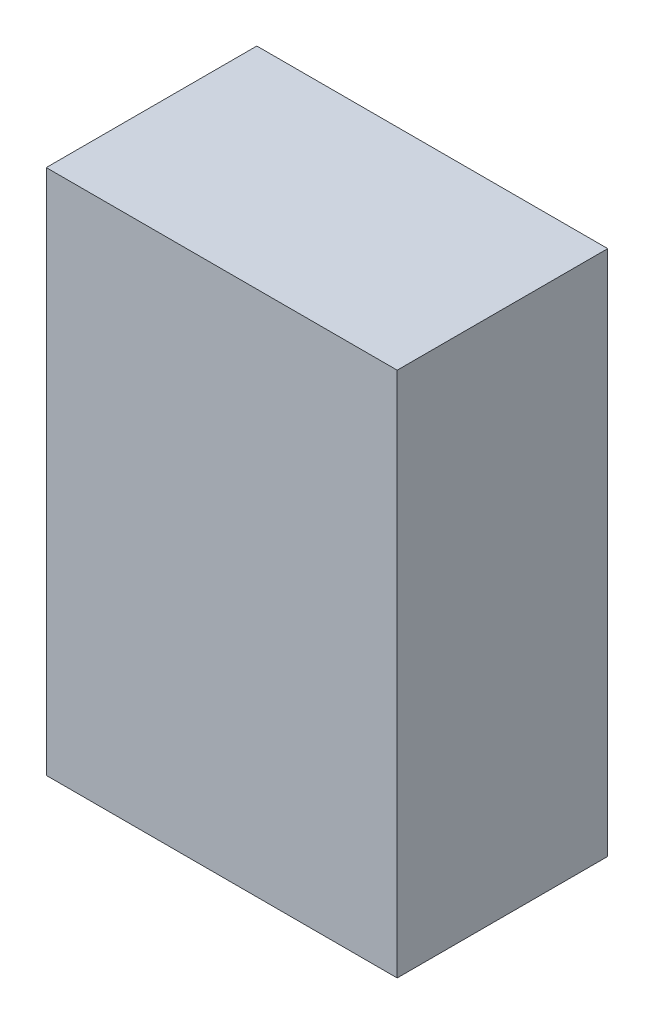
ISO-10303-21;
HEADER;
FILE_DESCRIPTION(('STEP AP214'),'2;1');
FILE_NAME('part.step','',(''),(''),'','','');
FILE_SCHEMA(('AUTOMOTIVE_DESIGN { 1 0 10303 214 1 1 1 1 }'));
ENDSEC;
DATA;
#1=APPLICATION_CONTEXT('core data for automotive mechanical design processes');
#2=APPLICATION_PROTOCOL_DEFINITION('international standard','automotive_design',2000,#1);
#3=PRODUCT_CONTEXT('',#1,'mechanical');
#4=PRODUCT('Part','Part','',(#3));
#5=PRODUCT_RELATED_PRODUCT_CATEGORY('part','',(#4));
#6=PRODUCT_DEFINITION_FORMATION('','',#4);
#7=PRODUCT_DEFINITION_CONTEXT('part definition',#1,'design');
#8=PRODUCT_DEFINITION('design','',#6,#7);
#9=PRODUCT_DEFINITION_SHAPE('','',#8);
#10=(LENGTH_UNIT() NAMED_UNIT(*) SI_UNIT(.MILLI.,.METRE.));
#11=(NAMED_UNIT(*) PLANE_ANGLE_UNIT() SI_UNIT($,.RADIAN.));
#12=(NAMED_UNIT(*) SI_UNIT($,.STERADIAN.) SOLID_ANGLE_UNIT());
#13=UNCERTAINTY_MEASURE_WITH_UNIT(LENGTH_MEASURE(1.E-05),#10,'distance_accuracy_value','');
#14=(GEOMETRIC_REPRESENTATION_CONTEXT(3) GLOBAL_UNCERTAINTY_ASSIGNED_CONTEXT((#13)) GLOBAL_UNIT_ASSIGNED_CONTEXT((#10,
#11,#12)) REPRESENTATION_CONTEXT('',''));
#15=CARTESIAN_POINT('',(0.,0.,0.));
#16=DIRECTION('',(0.,0.,1.));
#17=DIRECTION('',(1.,0.,0.));
#18=AXIS2_PLACEMENT_3D('',#15,#16,#17);
#19=CARTESIAN_POINT('',(0.,76.2,0.));
#20=DIRECTION('',(1.,0.,0.));
#21=DIRECTION('',(0.,0.,-1.));
#22=AXIS2_PLACEMENT_3D('',#19,#20,#21);
#23=PLANE('',#22);
#24=DIRECTION('',(0.,0.,1.));
#25=VECTOR('',#24,1.);
#26=CARTESIAN_POINT('',(0.,0.,0.));
#27=LINE('',#26,#25);
#28=CARTESIAN_POINT('',(0.,0.,-30.48));
#29=VERTEX_POINT('',#28);
#30=CARTESIAN_POINT('',(0.,0.,0.));
#31=VERTEX_POINT('',#30);
#32=EDGE_CURVE('E96',#29,#31,#27,.T.);
#33=ORIENTED_EDGE('',*,*,#32,.T.);
#34=DIRECTION('',(0.,-1.,0.));
#35=VECTOR('',#34,1.);
#36=CARTESIAN_POINT('',(0.,76.2,0.));
#37=LINE('',#36,#35);
#38=CARTESIAN_POINT('',(0.,76.2,0.));
#39=VERTEX_POINT('',#38);
#40=EDGE_CURVE('E11',#39,#31,#37,.T.);
#41=ORIENTED_EDGE('',*,*,#40,.F.);
#42=DIRECTION('',(0.,0.,1.));
#43=VECTOR('',#42,1.);
#44=CARTESIAN_POINT('',(0.,76.2,0.));
#45=LINE('',#44,#43);
#46=CARTESIAN_POINT('',(0.,76.2,-30.48));
#47=VERTEX_POINT('',#46);
#48=EDGE_CURVE('E84',#47,#39,#45,.T.);
#49=ORIENTED_EDGE('',*,*,#48,.F.);
#50=DIRECTION('',(0.,-1.,0.));
#51=VECTOR('',#50,1.);
#52=CARTESIAN_POINT('',(0.,76.2,-30.48));
#53=LINE('',#52,#51);
#54=EDGE_CURVE('E92',#47,#29,#53,.T.);
#55=ORIENTED_EDGE('',*,*,#54,.T.);
#56=EDGE_LOOP('',(#33,#41,#49,#55));
#57=FACE_BOUND('',#56,.T.);
#58=ADVANCED_FACE('F33',(#57),#23,.F.);
#59=CARTESIAN_POINT('',(0.,76.2,0.));
#60=DIRECTION('',(0.,0.,-1.));
#61=DIRECTION('',(-1.,0.,0.));
#62=AXIS2_PLACEMENT_3D('',#59,#60,#61);
#63=PLANE('',#62);
#64=DIRECTION('',(1.,0.,0.));
#65=VECTOR('',#64,1.);
#66=CARTESIAN_POINT('',(0.,0.,0.));
#67=LINE('',#66,#65);
#68=CARTESIAN_POINT('',(50.8,0.,0.));
#69=VERTEX_POINT('',#68);
#70=EDGE_CURVE('E88',#31,#69,#67,.T.);
#71=ORIENTED_EDGE('',*,*,#70,.T.);
#72=DIRECTION('',(0.,-1.,0.));
#73=VECTOR('',#72,1.);
#74=CARTESIAN_POINT('',(50.8,76.2,0.));
#75=LINE('',#74,#73);
#76=CARTESIAN_POINT('',(50.8,76.2,0.));
#77=VERTEX_POINT('',#76);
#78=EDGE_CURVE('E41',#77,#69,#75,.T.);
#79=ORIENTED_EDGE('',*,*,#78,.F.);
#80=DIRECTION('',(1.,0.,0.));
#81=VECTOR('',#80,1.);
#82=CARTESIAN_POINT('',(0.,76.2,0.));
#83=LINE('',#82,#81);
#84=EDGE_CURVE('E79',#39,#77,#83,.T.);
#85=ORIENTED_EDGE('',*,*,#84,.F.);
#86=ORIENTED_EDGE('',*,*,#40,.T.);
#87=EDGE_LOOP('',(#71,#79,#85,#86));
#88=FACE_BOUND('',#87,.T.);
#89=ADVANCED_FACE('F87',(#88),#63,.F.);
#90=CARTESIAN_POINT('',(50.8,76.2,0.));
#91=DIRECTION('',(-1.,0.,0.));
#92=DIRECTION('',(0.,0.,1.));
#93=AXIS2_PLACEMENT_3D('',#90,#91,#92);
#94=PLANE('',#93);
#95=DIRECTION('',(0.,0.,-1.));
#96=VECTOR('',#95,1.);
#97=CARTESIAN_POINT('',(50.8,0.,0.));
#98=LINE('',#97,#96);
#99=CARTESIAN_POINT('',(50.8,0.,-30.48));
#100=VERTEX_POINT('',#99);
#101=EDGE_CURVE('E66',#69,#100,#98,.T.);
#102=ORIENTED_EDGE('',*,*,#101,.T.);
#103=DIRECTION('',(0.,-1.,0.));
#104=VECTOR('',#103,1.);
#105=CARTESIAN_POINT('',(50.8,76.2,-30.48));
#106=LINE('',#105,#104);
#107=CARTESIAN_POINT('',(50.8,76.2,-30.48));
#108=VERTEX_POINT('',#107);
#109=EDGE_CURVE('E89',#108,#100,#106,.T.);
#110=ORIENTED_EDGE('',*,*,#109,.F.);
#111=DIRECTION('',(0.,0.,-1.));
#112=VECTOR('',#111,1.);
#113=CARTESIAN_POINT('',(50.8,76.2,0.));
#114=LINE('',#113,#112);
#115=EDGE_CURVE('E82',#77,#108,#114,.T.);
#116=ORIENTED_EDGE('',*,*,#115,.F.);
#117=ORIENTED_EDGE('',*,*,#78,.T.);
#118=EDGE_LOOP('',(#102,#110,#116,#117));
#119=FACE_BOUND('',#118,.T.);
#120=ADVANCED_FACE('F90',(#119),#94,.F.);
#121=CARTESIAN_POINT('',(0.,76.2,-30.48));
#122=DIRECTION('',(0.,0.,1.));
#123=DIRECTION('',(1.,0.,0.));
#124=AXIS2_PLACEMENT_3D('',#121,#122,#123);
#125=PLANE('',#124);
#126=DIRECTION('',(-1.,0.,0.));
#127=VECTOR('',#126,1.);
#128=CARTESIAN_POINT('',(0.,0.,-30.48));
#129=LINE('',#128,#127);
#130=EDGE_CURVE('E72',#100,#29,#129,.T.);
#131=ORIENTED_EDGE('',*,*,#130,.T.);
#132=ORIENTED_EDGE('',*,*,#54,.F.);
#133=DIRECTION('',(-1.,0.,0.));
#134=VECTOR('',#133,1.);
#135=CARTESIAN_POINT('',(0.,76.2,-30.48));
#136=LINE('',#135,#134);
#137=EDGE_CURVE('E49',#108,#47,#136,.T.);
#138=ORIENTED_EDGE('',*,*,#137,.F.);
#139=ORIENTED_EDGE('',*,*,#109,.T.);
#140=EDGE_LOOP('',(#131,#132,#138,#139));
#141=FACE_BOUND('',#140,.T.);
#142=ADVANCED_FACE('F103',(#141),#125,.F.);
#143=CARTESIAN_POINT('',(0.,76.2,0.));
#144=DIRECTION('',(0.,-1.,0.));
#145=DIRECTION('',(0.,0.,-1.));
#146=AXIS2_PLACEMENT_3D('',#143,#144,#145);
#147=PLANE('',#146);
#148=ORIENTED_EDGE('',*,*,#48,.T.);
#149=ORIENTED_EDGE('',*,*,#84,.T.);
#150=ORIENTED_EDGE('',*,*,#115,.T.);
#151=ORIENTED_EDGE('',*,*,#137,.T.);
#152=EDGE_LOOP('',(#148,#149,#150,#151));
#153=FACE_BOUND('',#152,.T.);
#154=ADVANCED_FACE('F80',(#153),#147,.F.);
#155=CARTESIAN_POINT('',(0.,0.,0.));
#156=DIRECTION('',(0.,-1.,0.));
#157=DIRECTION('',(0.,0.,-1.));
#158=AXIS2_PLACEMENT_3D('',#155,#156,#157);
#159=PLANE('',#158);
#160=ORIENTED_EDGE('',*,*,#32,.F.);
#161=ORIENTED_EDGE('',*,*,#130,.F.);
#162=ORIENTED_EDGE('',*,*,#101,.F.);
#163=ORIENTED_EDGE('',*,*,#70,.F.);
#164=EDGE_LOOP('',(#160,#161,#162,#163));
#165=FACE_BOUND('',#164,.T.);
#166=ADVANCED_FACE('F106',(#165),#159,.T.);
#167=CLOSED_SHELL('',(#58,#89,#120,#142,#154,#166));
#168=MANIFOLD_SOLID_BREP('B2',#167);
#169=ADVANCED_BREP_SHAPE_REPRESENTATION('',(#18,#168),#14);
#170=SHAPE_DEFINITION_REPRESENTATION(#9,#169);
ENDSEC;
END-ISO-10303-21;
